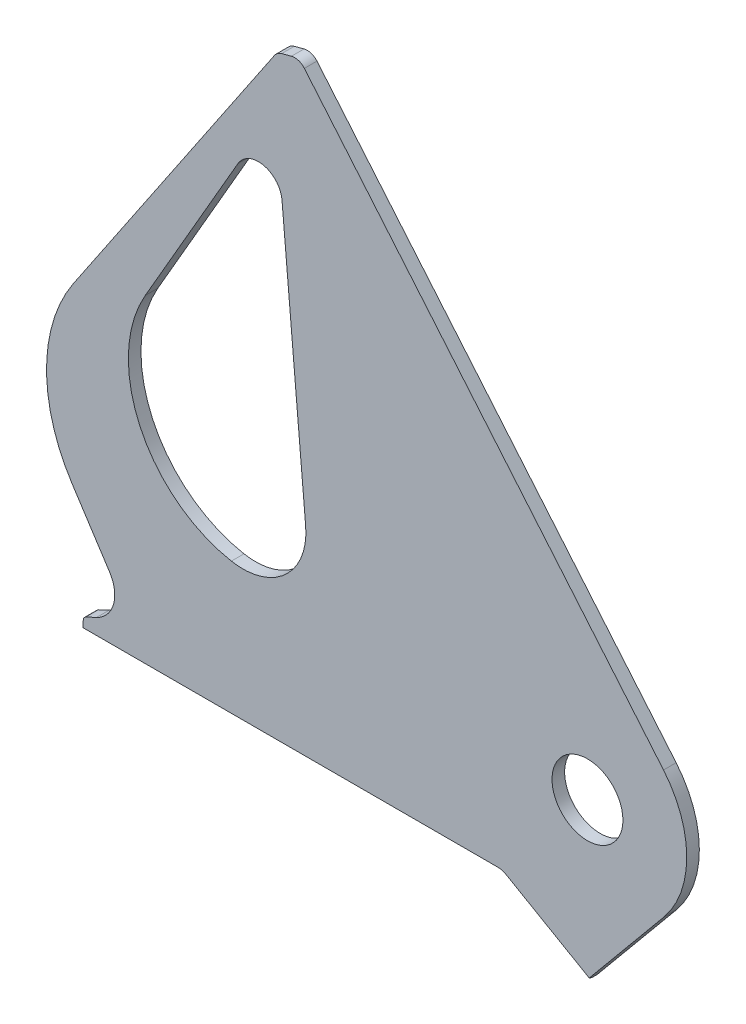
ISO-10303-21;
HEADER;
FILE_DESCRIPTION(('STEP AP214'),'2;1');
FILE_NAME('part.step','',(''),(''),'','','');
FILE_SCHEMA(('AUTOMOTIVE_DESIGN { 1 0 10303 214 1 1 1 1 }'));
ENDSEC;
DATA;
#1=APPLICATION_CONTEXT('core data for automotive mechanical design processes');
#2=APPLICATION_PROTOCOL_DEFINITION('international standard','automotive_design',2000,#1);
#3=PRODUCT_CONTEXT('',#1,'mechanical');
#4=PRODUCT('Part','Part','',(#3));
#5=PRODUCT_RELATED_PRODUCT_CATEGORY('part','',(#4));
#6=PRODUCT_DEFINITION_FORMATION('','',#4);
#7=PRODUCT_DEFINITION_CONTEXT('part definition',#1,'design');
#8=PRODUCT_DEFINITION('design','',#6,#7);
#9=PRODUCT_DEFINITION_SHAPE('','',#8);
#10=(LENGTH_UNIT() NAMED_UNIT(*) SI_UNIT(.MILLI.,.METRE.));
#11=(NAMED_UNIT(*) PLANE_ANGLE_UNIT() SI_UNIT($,.RADIAN.));
#12=(NAMED_UNIT(*) SI_UNIT($,.STERADIAN.) SOLID_ANGLE_UNIT());
#13=UNCERTAINTY_MEASURE_WITH_UNIT(LENGTH_MEASURE(1.E-05),#10,'distance_accuracy_value','');
#14=(GEOMETRIC_REPRESENTATION_CONTEXT(3) GLOBAL_UNCERTAINTY_ASSIGNED_CONTEXT((#13)) GLOBAL_UNIT_ASSIGNED_CONTEXT((#10,
#11,#12)) REPRESENTATION_CONTEXT('',''));
#15=CARTESIAN_POINT('',(0.,0.,0.));
#16=DIRECTION('',(0.,0.,1.));
#17=DIRECTION('',(1.,0.,0.));
#18=AXIS2_PLACEMENT_3D('',#15,#16,#17);
#19=CARTESIAN_POINT('',(0.,0.,8.));
#20=DIRECTION('',(0.,0.,1.));
#21=DIRECTION('',(1.,0.,0.));
#22=AXIS2_PLACEMENT_3D('',#19,#20,#21);
#23=PLANE('',#22);
#24=CARTESIAN_POINT('',(0.,0.,8.));
#25=DIRECTION('',(0.,0.,1.));
#26=DIRECTION('',(1.,0.,0.));
#27=AXIS2_PLACEMENT_3D('',#24,#25,#26);
#28=CIRCLE('',#27,22.5);
#29=CARTESIAN_POINT('',(22.5,0.,8.));
#30=VERTEX_POINT('',#29);
#31=EDGE_CURVE('E257',#30,#30,#28,.T.);
#32=ORIENTED_EDGE('',*,*,#31,.F.);
#33=EDGE_LOOP('',(#32));
#34=FACE_BOUND('',#33,.T.);
#35=CARTESIAN_POINT('',(-56.8038475772933,-75.5,8.));
#36=DIRECTION('',(0.,0.,1.));
#37=DIRECTION('',(1.,0.,0.));
#38=AXIS2_PLACEMENT_3D('',#35,#36,#37);
#39=CIRCLE('',#38,9.99999999999995);
#40=CARTESIAN_POINT('',(-56.8038475772933,-65.5,8.));
#41=VERTEX_POINT('',#40);
#42=CARTESIAN_POINT('',(-51.8038475772934,-66.8397459621557,8.));
#43=VERTEX_POINT('',#42);
#44=EDGE_CURVE('E383',#41,#43,#39,.F.);
#45=ORIENTED_EDGE('',*,*,#44,.T.);
#46=DIRECTION('',(0.866025403784438,-0.500000000000001,0.));
#47=VECTOR('',#46,1.);
#48=CARTESIAN_POINT('',(-2.10065359942493,-95.5358983848623,8.));
#49=LINE('',#48,#47);
#50=CARTESIAN_POINT('',(1.12300940505533,-97.3970810882756,8.));
#51=VERTEX_POINT('',#50);
#52=EDGE_CURVE('E385',#43,#51,#49,.T.);
#53=ORIENTED_EDGE('',*,*,#52,.T.);
#54=DIRECTION('',(0.637957541694237,0.770071538881581,0.));
#55=VECTOR('',#54,1.);
#56=CARTESIAN_POINT('',(-1.79043898278017,-100.913872625083,8.));
#57=LINE('',#56,#55);
#58=CARTESIAN_POINT('',(48.5145069495396,-40.1913251267369,8.));
#59=VERTEX_POINT('',#58);
#60=EDGE_CURVE('E290',#51,#59,#57,.T.);
#61=ORIENTED_EDGE('',*,*,#60,.T.);
#62=CARTESIAN_POINT('',(0.,0.,8.));
#63=DIRECTION('',(0.,0.,1.));
#64=DIRECTION('',(1.,0.,0.));
#65=AXIS2_PLACEMENT_3D('',#62,#63,#64);
#66=CIRCLE('',#65,63.);
#67=CARTESIAN_POINT('',(48.2607999164954,40.4956194102523,8.));
#68=VERTEX_POINT('',#67);
#69=EDGE_CURVE('E263',#59,#68,#66,.T.);
#70=ORIENTED_EDGE('',*,*,#69,.T.);
#71=DIRECTION('',(-0.642787609686544,0.766044443118974,0.));
#72=VECTOR('',#71,1.);
#73=CARTESIAN_POINT('',(48.2607999164954,40.4956194102523,8.));
#74=LINE('',#73,#72);
#75=CARTESIAN_POINT('',(-179.677830313201,312.142300877492,8.));
#76=VERTEX_POINT('',#75);
#77=EDGE_CURVE('E266',#68,#76,#74,.T.);
#78=ORIENTED_EDGE('',*,*,#77,.T.);
#79=CARTESIAN_POINT('',(-185.806185858152,307.,8.));
#80=DIRECTION('',(0.,0.,1.));
#81=DIRECTION('',(1.,0.,0.));
#82=AXIS2_PLACEMENT_3D('',#79,#80,#81);
#83=CIRCLE('',#82,7.99999999999965);
#84=CARTESIAN_POINT('',(-187.876738218973,314.727406610313,8.));
#85=VERTEX_POINT('',#84);
#86=EDGE_CURVE('E269',#76,#85,#83,.T.);
#87=ORIENTED_EDGE('',*,*,#86,.T.);
#88=DIRECTION('',(-0.965925826289066,-0.258819045102528,0.));
#89=VECTOR('',#88,1.);
#90=CARTESIAN_POINT('',(-187.876738218973,314.727406610313,8.));
#91=LINE('',#90,#89);
#92=CARTESIAN_POINT('',(-194.06467833063,313.069353054582,8.));
#93=VERTEX_POINT('',#92);
#94=EDGE_CURVE('E271',#85,#93,#91,.T.);
#95=ORIENTED_EDGE('',*,*,#94,.T.);
#96=CARTESIAN_POINT('',(-191.99412596981,305.34194644427,8.));
#97=DIRECTION('',(0.,0.,1.));
#98=DIRECTION('',(1.,0.,0.));
#99=AXIS2_PLACEMENT_3D('',#96,#97,#98);
#100=CIRCLE('',#99,7.99999999999958);
#101=CARTESIAN_POINT('',(-198.62642655025,309.815489672035,8.));
#102=VERTEX_POINT('',#101);
#103=EDGE_CURVE('E273',#93,#102,#100,.T.);
#104=ORIENTED_EDGE('',*,*,#103,.T.);
#105=DIRECTION('',(-0.559192903470742,-0.829037572555045,0.));
#106=VECTOR('',#105,1.);
#107=CARTESIAN_POINT('',(-198.62642655025,309.815489672035,8.));
#108=LINE('',#107,#106);
#109=CARTESIAN_POINT('',(-326.192869731939,120.690460118863,8.));
#110=VERTEX_POINT('',#109);
#111=EDGE_CURVE('E275',#102,#110,#108,.T.);
#112=ORIENTED_EDGE('',*,*,#111,.T.);
#113=CARTESIAN_POINT('',(-243.289112476434,64.7711697717891,8.));
#114=DIRECTION('',(0.,0.,1.));
#115=DIRECTION('',(1.,0.,0.));
#116=AXIS2_PLACEMENT_3D('',#113,#114,#115);
#117=CIRCLE('',#116,100.);
#118=CARTESIAN_POINT('',(-327.156169270976,10.307266270286,8.));
#119=VERTEX_POINT('',#118);
#120=EDGE_CURVE('E277',#110,#119,#117,.T.);
#121=ORIENTED_EDGE('',*,*,#120,.T.);
#122=DIRECTION('',(0.54463903501503,-0.838670567945422,0.));
#123=VECTOR('',#122,1.);
#124=CARTESIAN_POINT('',(-303.226588641092,-26.5410565404495,8.));
#125=LINE('',#124,#123);
#126=CARTESIAN_POINT('',(-303.226588641092,-26.5410565404495,8.));
#127=VERTEX_POINT('',#126);
#128=EDGE_CURVE('E279',#119,#127,#125,.T.);
#129=ORIENTED_EDGE('',*,*,#128,.T.);
#130=CARTESIAN_POINT('',(-320.,-37.4338372407501,8.));
#131=DIRECTION('',(0.,0.,-1.));
#132=DIRECTION('',(1.,0.,0.));
#133=AXIS2_PLACEMENT_3D('',#130,#131,#132);
#134=CIRCLE('',#133,20.);
#135=CARTESIAN_POINT('',(-311.547634765186,-55.5599929814831,8.));
#136=VERTEX_POINT('',#135);
#137=EDGE_CURVE('E281',#127,#136,#134,.T.);
#138=ORIENTED_EDGE('',*,*,#137,.T.);
#139=DIRECTION('',(-0.906307787036648,-0.422618261740704,0.));
#140=VECTOR('',#139,1.);
#141=CARTESIAN_POINT('',(-318.267854785222,-58.6936830413125,8.));
#142=LINE('',#141,#140);
#143=CARTESIAN_POINT('',(-318.267854785222,-58.6936830413126,8.));
#144=VERTEX_POINT('',#143);
#145=EDGE_CURVE('E283',#136,#144,#142,.T.);
#146=ORIENTED_EDGE('',*,*,#145,.T.);
#147=CARTESIAN_POINT('',(-317.,-61.4126064024225,8.));
#148=DIRECTION('',(0.,0.,1.));
#149=DIRECTION('',(-1.,0.,0.));
#150=AXIS2_PLACEMENT_3D('',#147,#148,#149);
#151=CIRCLE('',#150,2.99999999999998);
#152=CARTESIAN_POINT('',(-320.,-61.4126064024224,8.));
#153=VERTEX_POINT('',#152);
#154=EDGE_CURVE('E285',#144,#153,#151,.T.);
#155=ORIENTED_EDGE('',*,*,#154,.T.);
#156=DIRECTION('',(0.,-1.,0.));
#157=VECTOR('',#156,1.);
#158=CARTESIAN_POINT('',(-320.,-69.5,8.));
#159=LINE('',#158,#157);
#160=CARTESIAN_POINT('',(-320.,-65.5,8.));
#161=VERTEX_POINT('',#160);
#162=EDGE_CURVE('E287',#153,#161,#159,.T.);
#163=ORIENTED_EDGE('',*,*,#162,.T.);
#164=DIRECTION('',(1.,0.,0.));
#165=VECTOR('',#164,1.);
#166=CARTESIAN_POINT('',(-56.8038475772933,-65.5,8.));
#167=LINE('',#166,#165);
#168=EDGE_CURVE('E381',#161,#41,#167,.T.);
#169=ORIENTED_EDGE('',*,*,#168,.T.);
#170=EDGE_LOOP('',(#45,#53,#61,#70,#78,#87,#95,#104,#112,#121,#129,#138,#146,#155,#163,#169));
#171=FACE_BOUND('',#170,.T.);
#172=DIRECTION('',(-0.0871557427476516,0.996194698091746,0.));
#173=VECTOR('',#172,1.);
#174=CARTESIAN_POINT('',(-193.853659489582,232.607111100856,8.));
#175=LINE('',#174,#173);
#176=CARTESIAN_POINT('',(-178.838777943547,60.986229709906,8.));
#177=VERTEX_POINT('',#176);
#178=CARTESIAN_POINT('',(-193.853659489582,232.607111100856,8.));
#179=VERTEX_POINT('',#178);
#180=EDGE_CURVE('E218',#177,#179,#175,.T.);
#181=ORIENTED_EDGE('',*,*,#180,.F.);
#182=CARTESIAN_POINT('',(-218.686565867217,57.5,8.));
#183=DIRECTION('',(0.,0.,1.));
#184=DIRECTION('',(-1.,0.,0.));
#185=AXIS2_PLACEMENT_3D('',#182,#183,#184);
#186=CIRCLE('',#185,39.9999999999997);
#187=CARTESIAN_POINT('',(-225.994098770012,18.1731648505178,8.));
#188=VERTEX_POINT('',#187);
#189=EDGE_CURVE('E208',#188,#177,#186,.T.);
#190=ORIENTED_EDGE('',*,*,#189,.F.);
#191=CARTESIAN_POINT('',(-211.379032964422,96.8268351494827,8.));
#192=DIRECTION('',(0.,0.,1.));
#193=DIRECTION('',(-1.,0.,0.));
#194=AXIS2_PLACEMENT_3D('',#191,#192,#193);
#195=CIRCLE('',#194,80.);
#196=CARTESIAN_POINT('',(-280.661065267177,136.826835149483,8.));
#197=VERTEX_POINT('',#196);
#198=EDGE_CURVE('E238',#197,#188,#195,.T.);
#199=ORIENTED_EDGE('',*,*,#198,.F.);
#200=DIRECTION('',(-0.500000000000001,-0.866025403784438,0.));
#201=VECTOR('',#200,1.);
#202=CARTESIAN_POINT('',(-280.661065267177,136.826835149483,8.));
#203=LINE('',#202,#201);
#204=CARTESIAN_POINT('',(-221.786961017724,238.799774959641,8.));
#205=VERTEX_POINT('',#204);
#206=EDGE_CURVE('E233',#205,#197,#203,.T.);
#207=ORIENTED_EDGE('',*,*,#206,.F.);
#208=CARTESIAN_POINT('',(-208.796579960958,231.299774959641,8.));
#209=DIRECTION('',(0.,0.,1.));
#210=DIRECTION('',(-1.,0.,0.));
#211=AXIS2_PLACEMENT_3D('',#208,#209,#210);
#212=CIRCLE('',#211,15.);
#213=EDGE_CURVE('E231',#179,#205,#212,.T.);
#214=ORIENTED_EDGE('',*,*,#213,.F.);
#215=EDGE_LOOP('',(#181,#190,#199,#207,#214));
#216=FACE_BOUND('',#215,.T.);
#217=ADVANCED_FACE('F39',(#34,#171,#216),#23,.T.);
#218=CARTESIAN_POINT('',(0.,0.,0.));
#219=DIRECTION('',(0.,0.,1.));
#220=DIRECTION('',(1.,0.,0.));
#221=AXIS2_PLACEMENT_3D('',#218,#219,#220);
#222=PLANE('',#221);
#223=CARTESIAN_POINT('',(0.,0.,0.));
#224=DIRECTION('',(0.,0.,1.));
#225=DIRECTION('',(1.,0.,0.));
#226=AXIS2_PLACEMENT_3D('',#223,#224,#225);
#227=CIRCLE('',#226,22.5);
#228=CARTESIAN_POINT('',(22.5,0.,0.));
#229=VERTEX_POINT('',#228);
#230=EDGE_CURVE('E226',#229,#229,#227,.T.);
#231=ORIENTED_EDGE('',*,*,#230,.T.);
#232=EDGE_LOOP('',(#231));
#233=FACE_BOUND('',#232,.T.);
#234=CARTESIAN_POINT('',(0.,0.,0.));
#235=DIRECTION('',(0.,0.,1.));
#236=DIRECTION('',(1.,0.,0.));
#237=AXIS2_PLACEMENT_3D('',#234,#235,#236);
#238=CIRCLE('',#237,63.);
#239=CARTESIAN_POINT('',(48.5145069495396,-40.1913251267369,0.));
#240=VERTEX_POINT('',#239);
#241=CARTESIAN_POINT('',(48.2607999164954,40.4956194102523,0.));
#242=VERTEX_POINT('',#241);
#243=EDGE_CURVE('E260',#240,#242,#238,.T.);
#244=ORIENTED_EDGE('',*,*,#243,.F.);
#245=DIRECTION('',(0.637957541694237,0.770071538881581,0.));
#246=VECTOR('',#245,1.);
#247=CARTESIAN_POINT('',(-1.79043898278017,-100.913872625083,0.));
#248=LINE('',#247,#246);
#249=CARTESIAN_POINT('',(-1.79043898278017,-100.913872625083,0.));
#250=VERTEX_POINT('',#249);
#251=EDGE_CURVE('E267',#250,#240,#248,.T.);
#252=ORIENTED_EDGE('',*,*,#251,.F.);
#253=CARTESIAN_POINT('',(-4.10065359942491,-99.,0.));
#254=DIRECTION('',(0.,0.,1.));
#255=DIRECTION('',(1.,0.,0.));
#256=AXIS2_PLACEMENT_3D('',#253,#254,#255);
#257=CIRCLE('',#256,3.);
#258=CARTESIAN_POINT('',(-5.60065359942491,-101.598076211353,0.));
#259=VERTEX_POINT('',#258);
#260=EDGE_CURVE('E330',#259,#250,#257,.T.);
#261=ORIENTED_EDGE('',*,*,#260,.F.);
#262=DIRECTION('',(0.866025403784438,-0.500000000000001,0.));
#263=VECTOR('',#262,1.);
#264=CARTESIAN_POINT('',(-55.3038475772933,-72.9019237886467,0.));
#265=LINE('',#264,#263);
#266=CARTESIAN_POINT('',(-55.3038475772933,-72.9019237886467,0.));
#267=VERTEX_POINT('',#266);
#268=EDGE_CURVE('E327',#267,#259,#265,.T.);
#269=ORIENTED_EDGE('',*,*,#268,.F.);
#270=CARTESIAN_POINT('',(-56.8038475772933,-75.5,0.));
#271=DIRECTION('',(0.,0.,-1.));
#272=DIRECTION('',(-1.,0.,0.));
#273=AXIS2_PLACEMENT_3D('',#270,#271,#272);
#274=CIRCLE('',#273,3.);
#275=CARTESIAN_POINT('',(-56.8038475772933,-72.5,0.));
#276=VERTEX_POINT('',#275);
#277=EDGE_CURVE('E324',#276,#267,#274,.T.);
#278=ORIENTED_EDGE('',*,*,#277,.F.);
#279=DIRECTION('',(1.,0.,0.));
#280=VECTOR('',#279,1.);
#281=CARTESIAN_POINT('',(-317.,-72.5,0.));
#282=LINE('',#281,#280);
#283=CARTESIAN_POINT('',(-317.,-72.5,0.));
#284=VERTEX_POINT('',#283);
#285=EDGE_CURVE('E321',#284,#276,#282,.T.);
#286=ORIENTED_EDGE('',*,*,#285,.F.);
#287=CARTESIAN_POINT('',(-317.,-69.5,0.));
#288=DIRECTION('',(0.,0.,1.));
#289=DIRECTION('',(-1.,0.,0.));
#290=AXIS2_PLACEMENT_3D('',#287,#288,#289);
#291=CIRCLE('',#290,3.);
#292=CARTESIAN_POINT('',(-320.,-69.5,0.));
#293=VERTEX_POINT('',#292);
#294=EDGE_CURVE('E318',#293,#284,#291,.T.);
#295=ORIENTED_EDGE('',*,*,#294,.F.);
#296=DIRECTION('',(0.,-1.,0.));
#297=VECTOR('',#296,1.);
#298=CARTESIAN_POINT('',(-320.,-69.5,0.));
#299=LINE('',#298,#297);
#300=CARTESIAN_POINT('',(-320.,-61.4126064024224,0.));
#301=VERTEX_POINT('',#300);
#302=EDGE_CURVE('E315',#301,#293,#299,.T.);
#303=ORIENTED_EDGE('',*,*,#302,.F.);
#304=CARTESIAN_POINT('',(-317.,-61.4126064024225,0.));
#305=DIRECTION('',(0.,0.,1.));
#306=DIRECTION('',(-1.,0.,0.));
#307=AXIS2_PLACEMENT_3D('',#304,#305,#306);
#308=CIRCLE('',#307,2.99999999999998);
#309=CARTESIAN_POINT('',(-318.267854785222,-58.6936830413126,0.));
#310=VERTEX_POINT('',#309);
#311=EDGE_CURVE('E313',#310,#301,#308,.T.);
#312=ORIENTED_EDGE('',*,*,#311,.F.);
#313=DIRECTION('',(-0.906307787036648,-0.422618261740704,0.));
#314=VECTOR('',#313,1.);
#315=CARTESIAN_POINT('',(-318.267854785222,-58.6936830413125,0.));
#316=LINE('',#315,#314);
#317=CARTESIAN_POINT('',(-311.547634765186,-55.5599929814831,0.));
#318=VERTEX_POINT('',#317);
#319=EDGE_CURVE('E311',#318,#310,#316,.T.);
#320=ORIENTED_EDGE('',*,*,#319,.F.);
#321=CARTESIAN_POINT('',(-320.,-37.4338372407501,0.));
#322=DIRECTION('',(0.,0.,-1.));
#323=DIRECTION('',(1.,0.,0.));
#324=AXIS2_PLACEMENT_3D('',#321,#322,#323);
#325=CIRCLE('',#324,20.);
#326=CARTESIAN_POINT('',(-303.226588641092,-26.5410565404495,0.));
#327=VERTEX_POINT('',#326);
#328=EDGE_CURVE('E309',#327,#318,#325,.T.);
#329=ORIENTED_EDGE('',*,*,#328,.F.);
#330=DIRECTION('',(0.54463903501503,-0.838670567945422,0.));
#331=VECTOR('',#330,1.);
#332=CARTESIAN_POINT('',(-303.226588641092,-26.5410565404495,0.));
#333=LINE('',#332,#331);
#334=CARTESIAN_POINT('',(-327.156169270976,10.307266270286,0.));
#335=VERTEX_POINT('',#334);
#336=EDGE_CURVE('E307',#335,#327,#333,.T.);
#337=ORIENTED_EDGE('',*,*,#336,.F.);
#338=CARTESIAN_POINT('',(-243.289112476434,64.7711697717891,0.));
#339=DIRECTION('',(0.,0.,1.));
#340=DIRECTION('',(1.,0.,0.));
#341=AXIS2_PLACEMENT_3D('',#338,#339,#340);
#342=CIRCLE('',#341,100.);
#343=CARTESIAN_POINT('',(-326.192869731939,120.690460118863,0.));
#344=VERTEX_POINT('',#343);
#345=EDGE_CURVE('E305',#344,#335,#342,.T.);
#346=ORIENTED_EDGE('',*,*,#345,.F.);
#347=DIRECTION('',(-0.559192903470742,-0.829037572555045,0.));
#348=VECTOR('',#347,1.);
#349=CARTESIAN_POINT('',(-198.62642655025,309.815489672035,0.));
#350=LINE('',#349,#348);
#351=CARTESIAN_POINT('',(-198.62642655025,309.815489672035,0.));
#352=VERTEX_POINT('',#351);
#353=EDGE_CURVE('E303',#352,#344,#350,.T.);
#354=ORIENTED_EDGE('',*,*,#353,.F.);
#355=CARTESIAN_POINT('',(-191.99412596981,305.34194644427,0.));
#356=DIRECTION('',(0.,0.,1.));
#357=DIRECTION('',(1.,0.,0.));
#358=AXIS2_PLACEMENT_3D('',#355,#356,#357);
#359=CIRCLE('',#358,7.99999999999958);
#360=CARTESIAN_POINT('',(-194.06467833063,313.069353054582,0.));
#361=VERTEX_POINT('',#360);
#362=EDGE_CURVE('E301',#361,#352,#359,.T.);
#363=ORIENTED_EDGE('',*,*,#362,.F.);
#364=DIRECTION('',(-0.965925826289066,-0.258819045102528,0.));
#365=VECTOR('',#364,1.);
#366=CARTESIAN_POINT('',(-187.876738218973,314.727406610313,0.));
#367=LINE('',#366,#365);
#368=CARTESIAN_POINT('',(-187.876738218973,314.727406610313,0.));
#369=VERTEX_POINT('',#368);
#370=EDGE_CURVE('E299',#369,#361,#367,.T.);
#371=ORIENTED_EDGE('',*,*,#370,.F.);
#372=CARTESIAN_POINT('',(-185.806185858152,307.,0.));
#373=DIRECTION('',(0.,0.,1.));
#374=DIRECTION('',(1.,0.,0.));
#375=AXIS2_PLACEMENT_3D('',#372,#373,#374);
#376=CIRCLE('',#375,7.99999999999965);
#377=CARTESIAN_POINT('',(-179.677830313201,312.142300877492,0.));
#378=VERTEX_POINT('',#377);
#379=EDGE_CURVE('E297',#378,#369,#376,.T.);
#380=ORIENTED_EDGE('',*,*,#379,.F.);
#381=DIRECTION('',(-0.642787609686544,0.766044443118974,0.));
#382=VECTOR('',#381,1.);
#383=CARTESIAN_POINT('',(48.2607999164954,40.4956194102523,0.));
#384=LINE('',#383,#382);
#385=EDGE_CURVE('E295',#242,#378,#384,.T.);
#386=ORIENTED_EDGE('',*,*,#385,.F.);
#387=EDGE_LOOP('',(#244,#252,#261,#269,#278,#286,#295,#303,#312,#320,#329,#337,#346,#354,#363,
#371,#380,#386));
#388=FACE_BOUND('',#387,.T.);
#389=CARTESIAN_POINT('',(-218.686565867217,57.5,0.));
#390=DIRECTION('',(0.,0.,1.));
#391=DIRECTION('',(-1.,0.,0.));
#392=AXIS2_PLACEMENT_3D('',#389,#390,#391);
#393=CIRCLE('',#392,39.9999999999997);
#394=CARTESIAN_POINT('',(-225.994098770012,18.1731648505178,0.));
#395=VERTEX_POINT('',#394);
#396=CARTESIAN_POINT('',(-178.838777943547,60.986229709906,0.));
#397=VERTEX_POINT('',#396);
#398=EDGE_CURVE('E240',#395,#397,#393,.T.);
#399=ORIENTED_EDGE('',*,*,#398,.T.);
#400=DIRECTION('',(-0.0871557427476516,0.996194698091746,0.));
#401=VECTOR('',#400,1.);
#402=CARTESIAN_POINT('',(-193.853659489582,232.607111100856,0.));
#403=LINE('',#402,#401);
#404=CARTESIAN_POINT('',(-193.853659489582,232.607111100856,0.));
#405=VERTEX_POINT('',#404);
#406=EDGE_CURVE('E225',#397,#405,#403,.T.);
#407=ORIENTED_EDGE('',*,*,#406,.T.);
#408=CARTESIAN_POINT('',(-208.796579960958,231.299774959641,0.));
#409=DIRECTION('',(0.,0.,1.));
#410=DIRECTION('',(-1.,0.,0.));
#411=AXIS2_PLACEMENT_3D('',#408,#409,#410);
#412=CIRCLE('',#411,15.);
#413=CARTESIAN_POINT('',(-221.786961017724,238.799774959641,0.));
#414=VERTEX_POINT('',#413);
#415=EDGE_CURVE('E243',#405,#414,#412,.T.);
#416=ORIENTED_EDGE('',*,*,#415,.T.);
#417=DIRECTION('',(-0.500000000000001,-0.866025403784438,0.));
#418=VECTOR('',#417,1.);
#419=CARTESIAN_POINT('',(-280.661065267177,136.826835149483,0.));
#420=LINE('',#419,#418);
#421=CARTESIAN_POINT('',(-280.661065267177,136.826835149483,0.));
#422=VERTEX_POINT('',#421);
#423=EDGE_CURVE('E246',#414,#422,#420,.T.);
#424=ORIENTED_EDGE('',*,*,#423,.T.);
#425=CARTESIAN_POINT('',(-211.379032964422,96.8268351494827,0.));
#426=DIRECTION('',(0.,0.,1.));
#427=DIRECTION('',(-1.,0.,0.));
#428=AXIS2_PLACEMENT_3D('',#425,#426,#427);
#429=CIRCLE('',#428,80.);
#430=EDGE_CURVE('E219',#422,#395,#429,.T.);
#431=ORIENTED_EDGE('',*,*,#430,.T.);
#432=EDGE_LOOP('',(#399,#407,#416,#424,#431));
#433=FACE_BOUND('',#432,.T.);
#434=ADVANCED_FACE('F427',(#233,#388,#433),#222,.F.);
#435=CARTESIAN_POINT('',(0.,0.,8.));
#436=DIRECTION('',(0.,0.,-1.));
#437=DIRECTION('',(-1.,0.,0.));
#438=AXIS2_PLACEMENT_3D('',#435,#436,#437);
#439=CYLINDRICAL_SURFACE('',#438,63.);
#440=ORIENTED_EDGE('',*,*,#243,.T.);
#441=DIRECTION('',(0.,0.,-1.));
#442=VECTOR('',#441,1.);
#443=CARTESIAN_POINT('',(48.2607999164954,40.4956194102523,8.));
#444=LINE('',#443,#442);
#445=EDGE_CURVE('E378',#68,#242,#444,.T.);
#446=ORIENTED_EDGE('',*,*,#445,.F.);
#447=ORIENTED_EDGE('',*,*,#69,.F.);
#448=DIRECTION('',(0.,0.,-1.));
#449=VECTOR('',#448,1.);
#450=CARTESIAN_POINT('',(48.5145069495396,-40.1913251267369,8.));
#451=LINE('',#450,#449);
#452=EDGE_CURVE('E292',#59,#240,#451,.T.);
#453=ORIENTED_EDGE('',*,*,#452,.T.);
#454=EDGE_LOOP('',(#440,#446,#447,#453));
#455=FACE_BOUND('',#454,.T.);
#456=ADVANCED_FACE('F456',(#455),#439,.T.);
#457=CARTESIAN_POINT('',(48.2607999164954,40.4956194102523,8.));
#458=DIRECTION('',(-0.766044443118974,-0.642787609686544,0.));
#459=DIRECTION('',(0.642787609686544,-0.766044443118974,0.));
#460=AXIS2_PLACEMENT_3D('',#457,#458,#459);
#461=PLANE('',#460);
#462=ORIENTED_EDGE('',*,*,#385,.T.);
#463=DIRECTION('',(0.,0.,-1.));
#464=VECTOR('',#463,1.);
#465=CARTESIAN_POINT('',(-179.677830313201,312.142300877492,8.));
#466=LINE('',#465,#464);
#467=EDGE_CURVE('E375',#76,#378,#466,.T.);
#468=ORIENTED_EDGE('',*,*,#467,.F.);
#469=ORIENTED_EDGE('',*,*,#77,.F.);
#470=ORIENTED_EDGE('',*,*,#445,.T.);
#471=EDGE_LOOP('',(#462,#468,#469,#470));
#472=FACE_BOUND('',#471,.T.);
#473=ADVANCED_FACE('F458',(#472),#461,.F.);
#474=CARTESIAN_POINT('',(-185.806185858152,307.,8.));
#475=DIRECTION('',(0.,0.,-1.));
#476=DIRECTION('',(-1.,0.,0.));
#477=AXIS2_PLACEMENT_3D('',#474,#475,#476);
#478=CYLINDRICAL_SURFACE('',#477,7.99999999999965);
#479=ORIENTED_EDGE('',*,*,#379,.T.);
#480=DIRECTION('',(0.,0.,-1.));
#481=VECTOR('',#480,1.);
#482=CARTESIAN_POINT('',(-187.876738218973,314.727406610313,8.));
#483=LINE('',#482,#481);
#484=EDGE_CURVE('E372',#85,#369,#483,.T.);
#485=ORIENTED_EDGE('',*,*,#484,.F.);
#486=ORIENTED_EDGE('',*,*,#86,.F.);
#487=ORIENTED_EDGE('',*,*,#467,.T.);
#488=EDGE_LOOP('',(#479,#485,#486,#487));
#489=FACE_BOUND('',#488,.T.);
#490=ADVANCED_FACE('F463',(#489),#478,.T.);
#491=CARTESIAN_POINT('',(-187.876738218973,314.727406610313,8.));
#492=DIRECTION('',(0.258819045102528,-0.965925826289066,0.));
#493=DIRECTION('',(0.965925826289066,0.258819045102528,0.));
#494=AXIS2_PLACEMENT_3D('',#491,#492,#493);
#495=PLANE('',#494);
#496=ORIENTED_EDGE('',*,*,#370,.T.);
#497=DIRECTION('',(0.,0.,-1.));
#498=VECTOR('',#497,1.);
#499=CARTESIAN_POINT('',(-194.06467833063,313.069353054582,8.));
#500=LINE('',#499,#498);
#501=EDGE_CURVE('E369',#93,#361,#500,.T.);
#502=ORIENTED_EDGE('',*,*,#501,.F.);
#503=ORIENTED_EDGE('',*,*,#94,.F.);
#504=ORIENTED_EDGE('',*,*,#484,.T.);
#505=EDGE_LOOP('',(#496,#502,#503,#504));
#506=FACE_BOUND('',#505,.T.);
#507=ADVANCED_FACE('F469',(#506),#495,.F.);
#508=CARTESIAN_POINT('',(-191.99412596981,305.34194644427,8.));
#509=DIRECTION('',(0.,0.,-1.));
#510=DIRECTION('',(-1.,0.,0.));
#511=AXIS2_PLACEMENT_3D('',#508,#509,#510);
#512=CYLINDRICAL_SURFACE('',#511,7.99999999999958);
#513=ORIENTED_EDGE('',*,*,#362,.T.);
#514=DIRECTION('',(0.,0.,-1.));
#515=VECTOR('',#514,1.);
#516=CARTESIAN_POINT('',(-198.62642655025,309.815489672035,8.));
#517=LINE('',#516,#515);
#518=EDGE_CURVE('E366',#102,#352,#517,.T.);
#519=ORIENTED_EDGE('',*,*,#518,.F.);
#520=ORIENTED_EDGE('',*,*,#103,.F.);
#521=ORIENTED_EDGE('',*,*,#501,.T.);
#522=EDGE_LOOP('',(#513,#519,#520,#521));
#523=FACE_BOUND('',#522,.T.);
#524=ADVANCED_FACE('F473',(#523),#512,.T.);
#525=CARTESIAN_POINT('',(-198.62642655025,309.815489672035,8.));
#526=DIRECTION('',(0.829037572555045,-0.559192903470742,0.));
#527=DIRECTION('',(0.559192903470742,0.829037572555045,0.));
#528=AXIS2_PLACEMENT_3D('',#525,#526,#527);
#529=PLANE('',#528);
#530=ORIENTED_EDGE('',*,*,#353,.T.);
#531=DIRECTION('',(0.,0.,-1.));
#532=VECTOR('',#531,1.);
#533=CARTESIAN_POINT('',(-326.192869731939,120.690460118863,8.));
#534=LINE('',#533,#532);
#535=EDGE_CURVE('E363',#110,#344,#534,.T.);
#536=ORIENTED_EDGE('',*,*,#535,.F.);
#537=ORIENTED_EDGE('',*,*,#111,.F.);
#538=ORIENTED_EDGE('',*,*,#518,.T.);
#539=EDGE_LOOP('',(#530,#536,#537,#538));
#540=FACE_BOUND('',#539,.T.);
#541=ADVANCED_FACE('F478',(#540),#529,.F.);
#542=CARTESIAN_POINT('',(-243.289112476434,64.7711697717891,8.));
#543=DIRECTION('',(0.,0.,-1.));
#544=DIRECTION('',(-1.,0.,0.));
#545=AXIS2_PLACEMENT_3D('',#542,#543,#544);
#546=CYLINDRICAL_SURFACE('',#545,100.);
#547=ORIENTED_EDGE('',*,*,#345,.T.);
#548=DIRECTION('',(0.,0.,-1.));
#549=VECTOR('',#548,1.);
#550=CARTESIAN_POINT('',(-327.156169270976,10.307266270286,8.));
#551=LINE('',#550,#549);
#552=EDGE_CURVE('E360',#119,#335,#551,.T.);
#553=ORIENTED_EDGE('',*,*,#552,.F.);
#554=ORIENTED_EDGE('',*,*,#120,.F.);
#555=ORIENTED_EDGE('',*,*,#535,.T.);
#556=EDGE_LOOP('',(#547,#553,#554,#555));
#557=FACE_BOUND('',#556,.T.);
#558=ADVANCED_FACE('F484',(#557),#546,.T.);
#559=CARTESIAN_POINT('',(-303.226588641092,-26.5410565404495,8.));
#560=DIRECTION('',(0.838670567945422,0.54463903501503,0.));
#561=DIRECTION('',(-0.54463903501503,0.838670567945422,0.));
#562=AXIS2_PLACEMENT_3D('',#559,#560,#561);
#563=PLANE('',#562);
#564=ORIENTED_EDGE('',*,*,#336,.T.);
#565=DIRECTION('',(0.,0.,-1.));
#566=VECTOR('',#565,1.);
#567=CARTESIAN_POINT('',(-303.226588641092,-26.5410565404495,8.));
#568=LINE('',#567,#566);
#569=EDGE_CURVE('E357',#127,#327,#568,.T.);
#570=ORIENTED_EDGE('',*,*,#569,.F.);
#571=ORIENTED_EDGE('',*,*,#128,.F.);
#572=ORIENTED_EDGE('',*,*,#552,.T.);
#573=EDGE_LOOP('',(#564,#570,#571,#572));
#574=FACE_BOUND('',#573,.T.);
#575=ADVANCED_FACE('F488',(#574),#563,.F.);
#576=CARTESIAN_POINT('',(-320.,-37.4338372407501,8.));
#577=DIRECTION('',(0.,0.,-1.));
#578=DIRECTION('',(-1.,0.,0.));
#579=AXIS2_PLACEMENT_3D('',#576,#577,#578);
#580=CYLINDRICAL_SURFACE('',#579,20.);
#581=ORIENTED_EDGE('',*,*,#328,.T.);
#582=DIRECTION('',(0.,0.,-1.));
#583=VECTOR('',#582,1.);
#584=CARTESIAN_POINT('',(-311.547634765186,-55.5599929814831,8.));
#585=LINE('',#584,#583);
#586=EDGE_CURVE('E354',#136,#318,#585,.T.);
#587=ORIENTED_EDGE('',*,*,#586,.F.);
#588=ORIENTED_EDGE('',*,*,#137,.F.);
#589=ORIENTED_EDGE('',*,*,#569,.T.);
#590=EDGE_LOOP('',(#581,#587,#588,#589));
#591=FACE_BOUND('',#590,.T.);
#592=ADVANCED_FACE('F493',(#591),#580,.F.);
#593=CARTESIAN_POINT('',(-318.267854785222,-58.6936830413125,8.));
#594=DIRECTION('',(0.422618261740704,-0.906307787036648,0.));
#595=DIRECTION('',(0.906307787036648,0.422618261740704,0.));
#596=AXIS2_PLACEMENT_3D('',#593,#594,#595);
#597=PLANE('',#596);
#598=ORIENTED_EDGE('',*,*,#319,.T.);
#599=DIRECTION('',(0.,0.,-1.));
#600=VECTOR('',#599,1.);
#601=CARTESIAN_POINT('',(-318.267854785222,-58.6936830413126,8.));
#602=LINE('',#601,#600);
#603=EDGE_CURVE('E351',#144,#310,#602,.T.);
#604=ORIENTED_EDGE('',*,*,#603,.F.);
#605=ORIENTED_EDGE('',*,*,#145,.F.);
#606=ORIENTED_EDGE('',*,*,#586,.T.);
#607=EDGE_LOOP('',(#598,#604,#605,#606));
#608=FACE_BOUND('',#607,.T.);
#609=ADVANCED_FACE('F495',(#608),#597,.F.);
#610=CARTESIAN_POINT('',(-317.,-61.4126064024225,8.));
#611=DIRECTION('',(0.,0.,-1.));
#612=DIRECTION('',(-1.,0.,0.));
#613=AXIS2_PLACEMENT_3D('',#610,#611,#612);
#614=CYLINDRICAL_SURFACE('',#613,2.99999999999998);
#615=ORIENTED_EDGE('',*,*,#311,.T.);
#616=DIRECTION('',(0.,0.,-1.));
#617=VECTOR('',#616,1.);
#618=CARTESIAN_POINT('',(-320.,-61.4126064024224,8.));
#619=LINE('',#618,#617);
#620=EDGE_CURVE('E348',#153,#301,#619,.T.);
#621=ORIENTED_EDGE('',*,*,#620,.F.);
#622=ORIENTED_EDGE('',*,*,#154,.F.);
#623=ORIENTED_EDGE('',*,*,#603,.T.);
#624=EDGE_LOOP('',(#615,#621,#622,#623));
#625=FACE_BOUND('',#624,.T.);
#626=ADVANCED_FACE('F421',(#625),#614,.T.);
#627=CARTESIAN_POINT('',(-320.,-69.5,8.));
#628=DIRECTION('',(1.,0.,0.));
#629=DIRECTION('',(0.,1.,0.));
#630=AXIS2_PLACEMENT_3D('',#627,#628,#629);
#631=PLANE('',#630);
#632=DIRECTION('',(0.,0.,-1.));
#633=VECTOR('',#632,1.);
#634=CARTESIAN_POINT('',(-320.,-69.5,8.));
#635=LINE('',#634,#633);
#636=CARTESIAN_POINT('',(-320.,-69.5,4.00000000000002));
#637=VERTEX_POINT('',#636);
#638=EDGE_CURVE('E346',#637,#293,#635,.T.);
#639=ORIENTED_EDGE('',*,*,#638,.F.);
#640=DIRECTION('',(0.,0.707106781186545,0.70710678118655));
#641=VECTOR('',#640,1.);
#642=CARTESIAN_POINT('',(-320.,-65.4999999999989,8.0000000000011));
#643=LINE('',#642,#641);
#644=EDGE_CURVE('E11',#637,#161,#643,.T.);
#645=ORIENTED_EDGE('',*,*,#644,.T.);
#646=ORIENTED_EDGE('',*,*,#162,.F.);
#647=ORIENTED_EDGE('',*,*,#620,.T.);
#648=ORIENTED_EDGE('',*,*,#302,.T.);
#649=EDGE_LOOP('',(#639,#645,#646,#647,#648));
#650=FACE_BOUND('',#649,.T.);
#651=ADVANCED_FACE('F414',(#650),#631,.F.);
#652=CARTESIAN_POINT('',(-317.,-69.5,8.));
#653=DIRECTION('',(0.,0.,-1.));
#654=DIRECTION('',(-1.,0.,0.));
#655=AXIS2_PLACEMENT_3D('',#652,#653,#654);
#656=CYLINDRICAL_SURFACE('',#655,3.);
#657=DIRECTION('',(0.,0.,-1.));
#658=VECTOR('',#657,1.);
#659=CARTESIAN_POINT('',(-317.,-72.5,8.));
#660=LINE('',#659,#658);
#661=CARTESIAN_POINT('',(-317.,-72.5,0.999999999999993));
#662=VERTEX_POINT('',#661);
#663=EDGE_CURVE('E344',#662,#284,#660,.T.);
#664=ORIENTED_EDGE('',*,*,#663,.F.);
#665=CARTESIAN_POINT('',(-317.,-69.5,4.00000000000002));
#666=DIRECTION('',(0.,-0.70710678118655,0.707106781186545));
#667=DIRECTION('',(0.,-0.707106781186545,-0.70710678118655));
#668=AXIS2_PLACEMENT_3D('',#665,#666,#667);
#669=ELLIPSE('',#668,4.24264068711931,3.);
#670=EDGE_CURVE('E48',#662,#637,#669,.F.);
#671=ORIENTED_EDGE('',*,*,#670,.T.);
#672=ORIENTED_EDGE('',*,*,#638,.T.);
#673=ORIENTED_EDGE('',*,*,#294,.T.);
#674=EDGE_LOOP('',(#664,#671,#672,#673));
#675=FACE_BOUND('',#674,.T.);
#676=ADVANCED_FACE('F432',(#675),#656,.T.);
#677=CARTESIAN_POINT('',(-317.,-72.5,8.));
#678=DIRECTION('',(0.,1.,0.));
#679=DIRECTION('',(0.,0.,1.));
#680=AXIS2_PLACEMENT_3D('',#677,#678,#679);
#681=PLANE('',#680);
#682=DIRECTION('',(0.,0.,-1.));
#683=VECTOR('',#682,1.);
#684=CARTESIAN_POINT('',(-56.8038475772933,-72.5,8.));
#685=LINE('',#684,#683);
#686=CARTESIAN_POINT('',(-56.8038475772933,-72.5,0.999999999999993));
#687=VERTEX_POINT('',#686);
#688=EDGE_CURVE('E342',#687,#276,#685,.T.);
#689=ORIENTED_EDGE('',*,*,#688,.F.);
#690=DIRECTION('',(-1.,0.,0.));
#691=VECTOR('',#690,1.);
#692=CARTESIAN_POINT('',(-317.,-72.5,0.999999999999993));
#693=LINE('',#692,#691);
#694=EDGE_CURVE('E63',#687,#662,#693,.T.);
#695=ORIENTED_EDGE('',*,*,#694,.T.);
#696=ORIENTED_EDGE('',*,*,#663,.T.);
#697=ORIENTED_EDGE('',*,*,#285,.T.);
#698=EDGE_LOOP('',(#689,#695,#696,#697));
#699=FACE_BOUND('',#698,.T.);
#700=ADVANCED_FACE('F433',(#699),#681,.F.);
#701=CARTESIAN_POINT('',(-56.8038475772933,-75.5,8.));
#702=DIRECTION('',(0.,0.,-1.));
#703=DIRECTION('',(-1.,0.,0.));
#704=AXIS2_PLACEMENT_3D('',#701,#702,#703);
#705=CYLINDRICAL_SURFACE('',#704,3.);
#706=DIRECTION('',(0.,0.,-1.));
#707=VECTOR('',#706,1.);
#708=CARTESIAN_POINT('',(-55.3038475772933,-72.9019237886467,8.));
#709=LINE('',#708,#707);
#710=CARTESIAN_POINT('',(-55.3038475772933,-72.9019237886467,0.999999999999993));
#711=VERTEX_POINT('',#710);
#712=EDGE_CURVE('E340',#711,#267,#709,.T.);
#713=ORIENTED_EDGE('',*,*,#712,.F.);
#714=CARTESIAN_POINT('',(-56.8038475772933,-75.5,0.999999999999993));
#715=DIRECTION('',(0.,0.,1.));
#716=DIRECTION('',(1.,0.,0.));
#717=AXIS2_PLACEMENT_3D('',#714,#715,#716);
#718=CIRCLE('',#717,3.);
#719=EDGE_CURVE('E394',#711,#687,#718,.T.);
#720=ORIENTED_EDGE('',*,*,#719,.T.);
#721=ORIENTED_EDGE('',*,*,#688,.T.);
#722=ORIENTED_EDGE('',*,*,#277,.T.);
#723=EDGE_LOOP('',(#713,#720,#721,#722));
#724=FACE_BOUND('',#723,.T.);
#725=ADVANCED_FACE('F438',(#724),#705,.F.);
#726=CARTESIAN_POINT('',(-55.3038475772933,-72.9019237886467,8.));
#727=DIRECTION('',(0.500000000000001,0.866025403784438,0.));
#728=DIRECTION('',(-0.866025403784438,0.500000000000001,0.));
#729=AXIS2_PLACEMENT_3D('',#726,#727,#728);
#730=PLANE('',#729);
#731=DIRECTION('',(0.,0.,-1.));
#732=VECTOR('',#731,1.);
#733=CARTESIAN_POINT('',(-5.60065359942491,-101.598076211353,8.));
#734=LINE('',#733,#732);
#735=CARTESIAN_POINT('',(-5.60065359942491,-101.598076211353,0.999999999999993));
#736=VERTEX_POINT('',#735);
#737=EDGE_CURVE('E338',#736,#259,#734,.T.);
#738=ORIENTED_EDGE('',*,*,#737,.F.);
#739=DIRECTION('',(-0.866025403784438,0.500000000000001,0.));
#740=VECTOR('',#739,1.);
#741=CARTESIAN_POINT('',(-55.3038475772933,-72.9019237886467,0.999999999999993));
#742=LINE('',#741,#740);
#743=EDGE_CURVE('E392',#736,#711,#742,.T.);
#744=ORIENTED_EDGE('',*,*,#743,.T.);
#745=ORIENTED_EDGE('',*,*,#712,.T.);
#746=ORIENTED_EDGE('',*,*,#268,.T.);
#747=EDGE_LOOP('',(#738,#744,#745,#746));
#748=FACE_BOUND('',#747,.T.);
#749=ADVANCED_FACE('F441',(#748),#730,.F.);
#750=CARTESIAN_POINT('',(-4.10065359942491,-99.,8.));
#751=DIRECTION('',(0.,0.,-1.));
#752=DIRECTION('',(-1.,0.,0.));
#753=AXIS2_PLACEMENT_3D('',#750,#751,#752);
#754=CYLINDRICAL_SURFACE('',#753,3.);
#755=DIRECTION('',(0.,0.,-1.));
#756=VECTOR('',#755,1.);
#757=CARTESIAN_POINT('',(-1.79043898278017,-100.913872625083,8.));
#758=LINE('',#757,#756);
#759=CARTESIAN_POINT('',(-1.79043898278017,-100.913872625083,3.49764499539317));
#760=VERTEX_POINT('',#759);
#761=EDGE_CURVE('E336',#760,#250,#758,.T.);
#762=ORIENTED_EDGE('',*,*,#761,.F.);
#763=CARTESIAN_POINT('',(-4.10065359942491,-99.,4.00000000000003));
#764=DIRECTION('',(-0.353553390593276,-0.612372435695796,0.707106781186545));
#765=DIRECTION('',(-0.353553390593273,-0.612372435695791,-0.70710678118655));
#766=AXIS2_PLACEMENT_3D('',#763,#764,#765);
#767=ELLIPSE('',#766,4.2426406871193,3.);
#768=EDGE_CURVE('E390',#760,#736,#767,.F.);
#769=ORIENTED_EDGE('',*,*,#768,.T.);
#770=ORIENTED_EDGE('',*,*,#737,.T.);
#771=ORIENTED_EDGE('',*,*,#260,.T.);
#772=EDGE_LOOP('',(#762,#769,#770,#771));
#773=FACE_BOUND('',#772,.T.);
#774=ADVANCED_FACE('F446',(#773),#754,.T.);
#775=CARTESIAN_POINT('',(-1.79043898278017,-100.913872625083,8.));
#776=DIRECTION('',(-0.770071538881581,0.637957541694237,0.));
#777=DIRECTION('',(-0.637957541694237,-0.770071538881581,0.));
#778=AXIS2_PLACEMENT_3D('',#775,#776,#777);
#779=PLANE('',#778);
#780=ORIENTED_EDGE('',*,*,#60,.F.);
#781=DIRECTION('',(-0.454299994916495,-0.548380532143492,-0.702061469235346));
#782=VECTOR('',#781,1.);
#783=CARTESIAN_POINT('',(-1.56782456999231,-100.645157213431,3.841666574666));
#784=LINE('',#783,#782);
#785=EDGE_CURVE('E388',#51,#760,#784,.T.);
#786=ORIENTED_EDGE('',*,*,#785,.T.);
#787=ORIENTED_EDGE('',*,*,#761,.T.);
#788=ORIENTED_EDGE('',*,*,#251,.T.);
#789=ORIENTED_EDGE('',*,*,#452,.F.);
#790=EDGE_LOOP('',(#780,#786,#787,#788,#789));
#791=FACE_BOUND('',#790,.T.);
#792=ADVANCED_FACE('F450',(#791),#779,.F.);
#793=CARTESIAN_POINT('',(0.,0.,8.));
#794=DIRECTION('',(0.,0.,-1.));
#795=DIRECTION('',(-1.,0.,0.));
#796=AXIS2_PLACEMENT_3D('',#793,#794,#795);
#797=CYLINDRICAL_SURFACE('',#796,22.5);
#798=ORIENTED_EDGE('',*,*,#31,.T.);
#799=EDGE_LOOP('',(#798));
#800=FACE_BOUND('',#799,.T.);
#801=ORIENTED_EDGE('',*,*,#230,.F.);
#802=EDGE_LOOP('',(#801));
#803=FACE_BOUND('',#802,.T.);
#804=ADVANCED_FACE('F516',(#800,#803),#797,.F.);
#805=CARTESIAN_POINT('',(-218.686565867217,57.5,8.));
#806=DIRECTION('',(0.,0.,-1.));
#807=DIRECTION('',(-1.,0.,0.));
#808=AXIS2_PLACEMENT_3D('',#805,#806,#807);
#809=CYLINDRICAL_SURFACE('',#808,39.9999999999997);
#810=ORIENTED_EDGE('',*,*,#398,.F.);
#811=DIRECTION('',(0.,0.,-1.));
#812=VECTOR('',#811,1.);
#813=CARTESIAN_POINT('',(-225.994098770012,18.1731648505178,8.));
#814=LINE('',#813,#812);
#815=EDGE_CURVE('E214',#188,#395,#814,.T.);
#816=ORIENTED_EDGE('',*,*,#815,.F.);
#817=ORIENTED_EDGE('',*,*,#189,.T.);
#818=DIRECTION('',(0.,0.,-1.));
#819=VECTOR('',#818,1.);
#820=CARTESIAN_POINT('',(-178.838777943547,60.986229709906,8.));
#821=LINE('',#820,#819);
#822=EDGE_CURVE('E211',#177,#397,#821,.T.);
#823=ORIENTED_EDGE('',*,*,#822,.T.);
#824=EDGE_LOOP('',(#810,#816,#817,#823));
#825=FACE_BOUND('',#824,.T.);
#826=ADVANCED_FACE('F210',(#825),#809,.F.);
#827=CARTESIAN_POINT('',(-193.853659489582,232.607111100856,8.));
#828=DIRECTION('',(-0.996194698091746,-0.0871557427476516,0.));
#829=DIRECTION('',(0.0871557427476516,-0.996194698091746,0.));
#830=AXIS2_PLACEMENT_3D('',#827,#828,#829);
#831=PLANE('',#830);
#832=ORIENTED_EDGE('',*,*,#406,.F.);
#833=ORIENTED_EDGE('',*,*,#822,.F.);
#834=ORIENTED_EDGE('',*,*,#180,.T.);
#835=DIRECTION('',(0.,0.,-1.));
#836=VECTOR('',#835,1.);
#837=CARTESIAN_POINT('',(-193.853659489582,232.607111100856,8.));
#838=LINE('',#837,#836);
#839=EDGE_CURVE('E227',#179,#405,#838,.T.);
#840=ORIENTED_EDGE('',*,*,#839,.T.);
#841=EDGE_LOOP('',(#832,#833,#834,#840));
#842=FACE_BOUND('',#841,.T.);
#843=ADVANCED_FACE('F222',(#842),#831,.T.);
#844=CARTESIAN_POINT('',(-208.796579960958,231.299774959641,8.));
#845=DIRECTION('',(0.,0.,-1.));
#846=DIRECTION('',(-1.,0.,0.));
#847=AXIS2_PLACEMENT_3D('',#844,#845,#846);
#848=CYLINDRICAL_SURFACE('',#847,15.);
#849=ORIENTED_EDGE('',*,*,#415,.F.);
#850=ORIENTED_EDGE('',*,*,#839,.F.);
#851=ORIENTED_EDGE('',*,*,#213,.T.);
#852=DIRECTION('',(0.,0.,-1.));
#853=VECTOR('',#852,1.);
#854=CARTESIAN_POINT('',(-221.786961017724,238.799774959641,8.));
#855=LINE('',#854,#853);
#856=EDGE_CURVE('E254',#205,#414,#855,.T.);
#857=ORIENTED_EDGE('',*,*,#856,.T.);
#858=EDGE_LOOP('',(#849,#850,#851,#857));
#859=FACE_BOUND('',#858,.T.);
#860=ADVANCED_FACE('F624',(#859),#848,.F.);
#861=CARTESIAN_POINT('',(-280.661065267177,136.826835149483,8.));
#862=DIRECTION('',(0.866025403784438,-0.500000000000001,0.));
#863=DIRECTION('',(0.500000000000001,0.866025403784438,0.));
#864=AXIS2_PLACEMENT_3D('',#861,#862,#863);
#865=PLANE('',#864);
#866=ORIENTED_EDGE('',*,*,#423,.F.);
#867=ORIENTED_EDGE('',*,*,#856,.F.);
#868=ORIENTED_EDGE('',*,*,#206,.T.);
#869=DIRECTION('',(0.,0.,-1.));
#870=VECTOR('',#869,1.);
#871=CARTESIAN_POINT('',(-280.661065267177,136.826835149483,8.));
#872=LINE('',#871,#870);
#873=EDGE_CURVE('E252',#197,#422,#872,.T.);
#874=ORIENTED_EDGE('',*,*,#873,.T.);
#875=EDGE_LOOP('',(#866,#867,#868,#874));
#876=FACE_BOUND('',#875,.T.);
#877=ADVANCED_FACE('F631',(#876),#865,.T.);
#878=CARTESIAN_POINT('',(-211.379032964422,96.8268351494827,8.));
#879=DIRECTION('',(0.,0.,-1.));
#880=DIRECTION('',(-1.,0.,0.));
#881=AXIS2_PLACEMENT_3D('',#878,#879,#880);
#882=CYLINDRICAL_SURFACE('',#881,80.);
#883=ORIENTED_EDGE('',*,*,#430,.F.);
#884=ORIENTED_EDGE('',*,*,#873,.F.);
#885=ORIENTED_EDGE('',*,*,#198,.T.);
#886=ORIENTED_EDGE('',*,*,#815,.T.);
#887=EDGE_LOOP('',(#883,#884,#885,#886));
#888=FACE_BOUND('',#887,.T.);
#889=ADVANCED_FACE('F565',(#888),#882,.F.);
#890=CARTESIAN_POINT('',(0.,-65.5,8.));
#891=DIRECTION('',(0.,-0.70710678118655,0.707106781186545));
#892=DIRECTION('',(0.,-0.707106781186545,-0.70710678118655));
#893=AXIS2_PLACEMENT_3D('',#890,#891,#892);
#894=PLANE('',#893);
#895=ORIENTED_EDGE('',*,*,#670,.F.);
#896=ORIENTED_EDGE('',*,*,#694,.F.);
#897=DIRECTION('',(0.,-0.707106781186545,-0.70710678118655));
#898=VECTOR('',#897,1.);
#899=CARTESIAN_POINT('',(-56.8038475772933,-65.5,8.));
#900=LINE('',#899,#898);
#901=EDGE_CURVE('E43',#41,#687,#900,.T.);
#902=ORIENTED_EDGE('',*,*,#901,.F.);
#903=ORIENTED_EDGE('',*,*,#168,.F.);
#904=ORIENTED_EDGE('',*,*,#644,.F.);
#905=EDGE_LOOP('',(#895,#896,#902,#903,#904));
#906=FACE_BOUND('',#905,.T.);
#907=ADVANCED_FACE('F41',(#906),#894,.T.);
#908=CARTESIAN_POINT('',(-56.8038475772933,-75.5,8.));
#909=DIRECTION('',(0.,0.,1.));
#910=DIRECTION('',(1.,0.,0.));
#911=AXIS2_PLACEMENT_3D('',#908,#909,#910);
#912=CONICAL_SURFACE('',#911,9.99999999999995,0.785398163397444);
#913=ORIENTED_EDGE('',*,*,#901,.T.);
#914=ORIENTED_EDGE('',*,*,#719,.F.);
#915=DIRECTION('',(-0.353553390593274,-0.612372435695791,-0.70710678118655));
#916=VECTOR('',#915,1.);
#917=CARTESIAN_POINT('',(-51.8038475772934,-66.8397459621557,8.));
#918=LINE('',#917,#916);
#919=EDGE_CURVE('E397',#43,#711,#918,.T.);
#920=ORIENTED_EDGE('',*,*,#919,.F.);
#921=ORIENTED_EDGE('',*,*,#44,.F.);
#922=EDGE_LOOP('',(#913,#914,#920,#921));
#923=FACE_BOUND('',#922,.T.);
#924=ADVANCED_FACE('F408',(#923),#912,.F.);
#925=CARTESIAN_POINT('',(-41.893420887186,-72.5615334794732,8.));
#926=DIRECTION('',(-0.353553390593276,-0.612372435695796,0.707106781186545));
#927=DIRECTION('',(0.,-0.755928946018452,-0.65465367070798));
#928=AXIS2_PLACEMENT_3D('',#925,#926,#927);
#929=PLANE('',#928);
#930=ORIENTED_EDGE('',*,*,#919,.T.);
#931=ORIENTED_EDGE('',*,*,#743,.F.);
#932=ORIENTED_EDGE('',*,*,#768,.F.);
#933=ORIENTED_EDGE('',*,*,#785,.F.);
#934=ORIENTED_EDGE('',*,*,#52,.F.);
#935=EDGE_LOOP('',(#930,#931,#932,#933,#934));
#936=FACE_BOUND('',#935,.T.);
#937=ADVANCED_FACE('F443',(#936),#929,.T.);
#938=CLOSED_SHELL('',(#217,#434,#456,#473,#490,#507,#524,#541,#558,#575,#592,#609,#626,#651,
#676,#700,#725,#749,#774,#792,#804,#826,#843,#860,#877,#889,#907,#924,#937));
#939=MANIFOLD_SOLID_BREP('B2',#938);
#940=ADVANCED_BREP_SHAPE_REPRESENTATION('',(#18,#939),#14);
#941=SHAPE_DEFINITION_REPRESENTATION(#9,#940);
ENDSEC;
END-ISO-10303-21;
